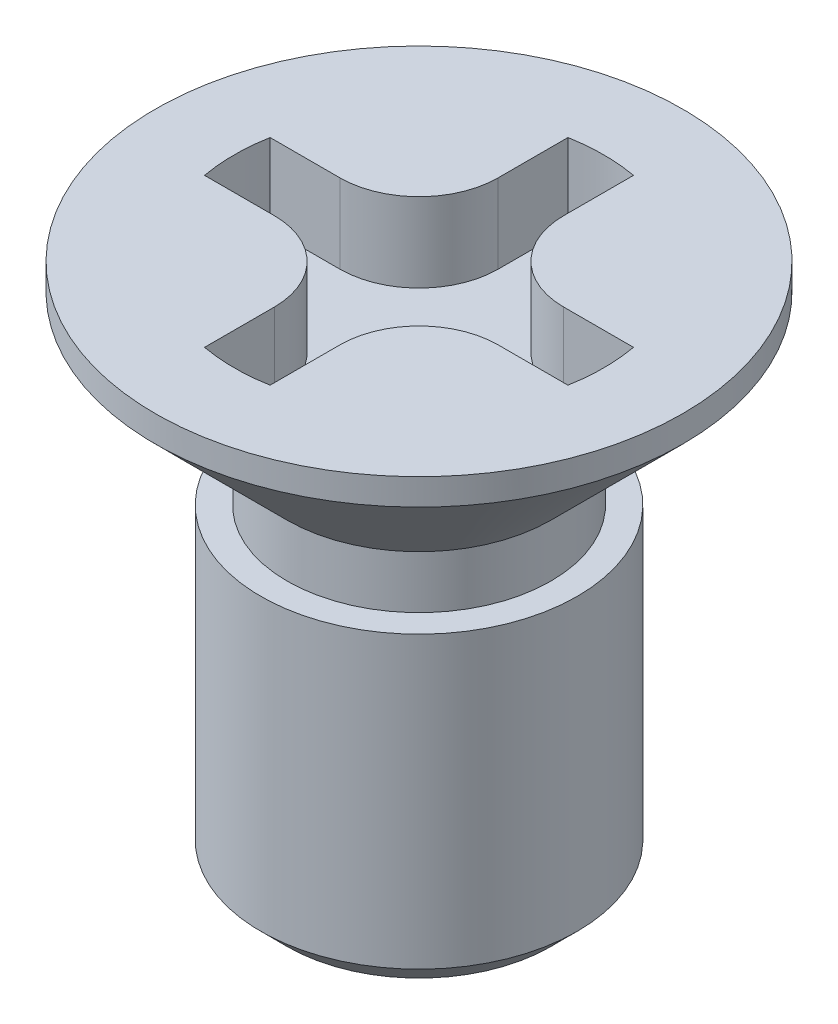
ISO-10303-21;
HEADER;
FILE_DESCRIPTION(('STEP AP214'),'2;1');
FILE_NAME('part.step','',(''),(''),'','','');
FILE_SCHEMA(('AUTOMOTIVE_DESIGN { 1 0 10303 214 1 1 1 1 }'));
ENDSEC;
DATA;
#1=APPLICATION_CONTEXT('core data for automotive mechanical design processes');
#2=APPLICATION_PROTOCOL_DEFINITION('international standard','automotive_design',2000,#1);
#3=PRODUCT_CONTEXT('',#1,'mechanical');
#4=PRODUCT('Part','Part','',(#3));
#5=PRODUCT_RELATED_PRODUCT_CATEGORY('part','',(#4));
#6=PRODUCT_DEFINITION_FORMATION('','',#4);
#7=PRODUCT_DEFINITION_CONTEXT('part definition',#1,'design');
#8=PRODUCT_DEFINITION('design','',#6,#7);
#9=PRODUCT_DEFINITION_SHAPE('','',#8);
#10=(LENGTH_UNIT() NAMED_UNIT(*) SI_UNIT(.MILLI.,.METRE.));
#11=(NAMED_UNIT(*) PLANE_ANGLE_UNIT() SI_UNIT($,.RADIAN.));
#12=(NAMED_UNIT(*) SI_UNIT($,.STERADIAN.) SOLID_ANGLE_UNIT());
#13=UNCERTAINTY_MEASURE_WITH_UNIT(LENGTH_MEASURE(1.E-05),#10,'distance_accuracy_value','');
#14=(GEOMETRIC_REPRESENTATION_CONTEXT(3) GLOBAL_UNCERTAINTY_ASSIGNED_CONTEXT((#13)) GLOBAL_UNIT_ASSIGNED_CONTEXT((#10,
#11,#12)) REPRESENTATION_CONTEXT('',''));
#15=CARTESIAN_POINT('',(0.,0.,0.));
#16=DIRECTION('',(0.,0.,1.));
#17=DIRECTION('',(1.,0.,0.));
#18=AXIS2_PLACEMENT_3D('',#15,#16,#17);
#19=CARTESIAN_POINT('',(0.,0.75,0.));
#20=DIRECTION('',(0.,-1.,0.));
#21=DIRECTION('',(0.,0.,-1.));
#22=AXIS2_PLACEMENT_3D('',#19,#20,#21);
#23=PLANE('',#22);
#24=DIRECTION('',(-1.,0.,0.));
#25=VECTOR('',#24,1.);
#26=CARTESIAN_POINT('',(-1.06066017178,0.75,0.3106601717798));
#27=LINE('',#26,#25);
#28=CARTESIAN_POINT('',(-1.06066017178,0.75,0.3106601717798));
#29=VERTEX_POINT('',#28);
#30=CARTESIAN_POINT('',(-1.722205056801,0.75,0.3106601717798));
#31=VERTEX_POINT('',#30);
#32=EDGE_CURVE('E335',#29,#31,#27,.T.);
#33=ORIENTED_EDGE('',*,*,#32,.F.);
#34=CARTESIAN_POINT('',(-1.06066017178,0.75,1.06066017178));
#35=DIRECTION('',(0.,1.,0.));
#36=DIRECTION('',(1.,0.,0.));
#37=AXIS2_PLACEMENT_3D('',#34,#35,#36);
#38=CIRCLE('',#37,0.75);
#39=CARTESIAN_POINT('',(-0.3106601717798,0.75,1.06066017178));
#40=VERTEX_POINT('',#39);
#41=EDGE_CURVE('E11',#40,#29,#38,.T.);
#42=ORIENTED_EDGE('',*,*,#41,.F.);
#43=DIRECTION('',(0.,0.,-1.));
#44=VECTOR('',#43,1.);
#45=CARTESIAN_POINT('',(-0.3106601717798,0.75,1.722205056801));
#46=LINE('',#45,#44);
#47=CARTESIAN_POINT('',(-0.3106601717798,0.75,1.722205056801));
#48=VERTEX_POINT('',#47);
#49=EDGE_CURVE('E42',#48,#40,#46,.T.);
#50=ORIENTED_EDGE('',*,*,#49,.F.);
#51=CARTESIAN_POINT('',(0.,0.75,0.));
#52=DIRECTION('',(0.,-1.,0.));
#53=DIRECTION('',(0.177520098159892,0.,0.984117175314658));
#54=AXIS2_PLACEMENT_3D('',#51,#52,#53);
#55=CIRCLE('',#54,1.75);
#56=CARTESIAN_POINT('',(0.3106601717798,0.75,1.722205056801));
#57=VERTEX_POINT('',#56);
#58=EDGE_CURVE('E264',#57,#48,#55,.T.);
#59=ORIENTED_EDGE('',*,*,#58,.F.);
#60=DIRECTION('',(0.,0.,1.));
#61=VECTOR('',#60,1.);
#62=CARTESIAN_POINT('',(0.3106601717798,0.75,1.06066017178));
#63=LINE('',#62,#61);
#64=CARTESIAN_POINT('',(0.3106601717798,0.75,1.06066017178));
#65=VERTEX_POINT('',#64);
#66=EDGE_CURVE('E265',#65,#57,#63,.T.);
#67=ORIENTED_EDGE('',*,*,#66,.F.);
#68=CARTESIAN_POINT('',(1.06066017178,0.75,1.06066017178));
#69=DIRECTION('',(0.,1.,0.));
#70=DIRECTION('',(0.,0.,-1.));
#71=AXIS2_PLACEMENT_3D('',#68,#69,#70);
#72=CIRCLE('',#71,0.75);
#73=CARTESIAN_POINT('',(1.06066017178,0.75,0.3106601717798));
#74=VERTEX_POINT('',#73);
#75=EDGE_CURVE('E253',#74,#65,#72,.T.);
#76=ORIENTED_EDGE('',*,*,#75,.F.);
#77=DIRECTION('',(-1.,0.,0.));
#78=VECTOR('',#77,1.);
#79=CARTESIAN_POINT('',(1.722205056801,0.75,0.3106601717798));
#80=LINE('',#79,#78);
#81=CARTESIAN_POINT('',(1.722205056801,0.75,0.3106601717798));
#82=VERTEX_POINT('',#81);
#83=EDGE_CURVE('E254',#82,#74,#80,.T.);
#84=ORIENTED_EDGE('',*,*,#83,.F.);
#85=CARTESIAN_POINT('',(0.,0.75,0.));
#86=DIRECTION('',(0.,-1.,0.));
#87=DIRECTION('',(0.984117175314658,0.,-0.177520098159892));
#88=AXIS2_PLACEMENT_3D('',#85,#86,#87);
#89=CIRCLE('',#88,1.75);
#90=CARTESIAN_POINT('',(1.722205056801,0.75,-0.3106601717798));
#91=VERTEX_POINT('',#90);
#92=EDGE_CURVE('E237',#91,#82,#89,.T.);
#93=ORIENTED_EDGE('',*,*,#92,.F.);
#94=DIRECTION('',(1.,0.,0.));
#95=VECTOR('',#94,1.);
#96=CARTESIAN_POINT('',(1.06066017178,0.75,-0.3106601717798));
#97=LINE('',#96,#95);
#98=CARTESIAN_POINT('',(1.06066017178,0.75,-0.3106601717798));
#99=VERTEX_POINT('',#98);
#100=EDGE_CURVE('E382',#99,#91,#97,.T.);
#101=ORIENTED_EDGE('',*,*,#100,.F.);
#102=CARTESIAN_POINT('',(1.06066017178,0.75,-1.06066017178));
#103=DIRECTION('',(0.,1.,0.));
#104=DIRECTION('',(-1.,0.,0.));
#105=AXIS2_PLACEMENT_3D('',#102,#103,#104);
#106=CIRCLE('',#105,0.75);
#107=CARTESIAN_POINT('',(0.3106601717798,0.75,-1.06066017178));
#108=VERTEX_POINT('',#107);
#109=EDGE_CURVE('E399',#108,#99,#106,.T.);
#110=ORIENTED_EDGE('',*,*,#109,.F.);
#111=DIRECTION('',(0.,0.,1.));
#112=VECTOR('',#111,1.);
#113=CARTESIAN_POINT('',(0.3106601717798,0.75,-1.722205056801));
#114=LINE('',#113,#112);
#115=CARTESIAN_POINT('',(0.3106601717798,0.75,-1.722205056801));
#116=VERTEX_POINT('',#115);
#117=EDGE_CURVE('E305',#116,#108,#114,.T.);
#118=ORIENTED_EDGE('',*,*,#117,.F.);
#119=CARTESIAN_POINT('',(0.,0.75,0.));
#120=DIRECTION('',(0.,-1.,0.));
#121=DIRECTION('',(-0.177520098159892,0.,-0.984117175314658));
#122=AXIS2_PLACEMENT_3D('',#119,#120,#121);
#123=CIRCLE('',#122,1.75);
#124=CARTESIAN_POINT('',(-0.3106601717798,0.75,-1.722205056801));
#125=VERTEX_POINT('',#124);
#126=EDGE_CURVE('E391',#125,#116,#123,.T.);
#127=ORIENTED_EDGE('',*,*,#126,.F.);
#128=DIRECTION('',(0.,0.,-1.));
#129=VECTOR('',#128,1.);
#130=CARTESIAN_POINT('',(-0.3106601717798,0.75,-1.06066017178));
#131=LINE('',#130,#129);
#132=CARTESIAN_POINT('',(-0.3106601717798,0.75,-1.06066017178));
#133=VERTEX_POINT('',#132);
#134=EDGE_CURVE('E295',#133,#125,#131,.T.);
#135=ORIENTED_EDGE('',*,*,#134,.F.);
#136=CARTESIAN_POINT('',(-1.06066017178,0.75,-1.06066017178));
#137=DIRECTION('',(0.,1.,0.));
#138=DIRECTION('',(0.,0.,1.));
#139=AXIS2_PLACEMENT_3D('',#136,#137,#138);
#140=CIRCLE('',#139,0.75);
#141=CARTESIAN_POINT('',(-1.06066017178,0.75,-0.3106601717798));
#142=VERTEX_POINT('',#141);
#143=EDGE_CURVE('E374',#142,#133,#140,.T.);
#144=ORIENTED_EDGE('',*,*,#143,.F.);
#145=DIRECTION('',(1.,0.,0.));
#146=VECTOR('',#145,1.);
#147=CARTESIAN_POINT('',(-1.722205056801,0.75,-0.3106601717798));
#148=LINE('',#147,#146);
#149=CARTESIAN_POINT('',(-1.722205056801,0.75,-0.3106601717798));
#150=VERTEX_POINT('',#149);
#151=EDGE_CURVE('E367',#150,#142,#148,.T.);
#152=ORIENTED_EDGE('',*,*,#151,.F.);
#153=CARTESIAN_POINT('',(0.,0.75,0.));
#154=DIRECTION('',(0.,-1.,0.));
#155=DIRECTION('',(-0.984117175314658,0.,0.177520098159892));
#156=AXIS2_PLACEMENT_3D('',#153,#154,#155);
#157=CIRCLE('',#156,1.75);
#158=EDGE_CURVE('E334',#31,#150,#157,.T.);
#159=ORIENTED_EDGE('',*,*,#158,.F.);
#160=EDGE_LOOP('',(#33,#42,#50,#59,#67,#76,#84,#93,#101,#110,#118,#127,#135,#144,#152,#159));
#161=FACE_BOUND('',#160,.T.);
#162=ADVANCED_FACE('F17',(#161),#23,.F.);
#163=CARTESIAN_POINT('',(-1.06066017178,0.75,1.06066017178));
#164=DIRECTION('',(0.,-1.,0.));
#165=DIRECTION('',(1.,0.,0.));
#166=AXIS2_PLACEMENT_3D('',#163,#164,#165);
#167=CYLINDRICAL_SURFACE('',#166,0.75);
#168=CARTESIAN_POINT('',(-1.06066017178,1.5,1.06066017178));
#169=DIRECTION('',(0.,1.,0.));
#170=DIRECTION('',(1.,0.,0.));
#171=AXIS2_PLACEMENT_3D('',#168,#169,#170);
#172=CIRCLE('',#171,0.75);
#173=CARTESIAN_POINT('',(-0.3106601717798,1.5,1.06066017178));
#174=VERTEX_POINT('',#173);
#175=CARTESIAN_POINT('',(-1.06066017178,1.5,0.3106601717798));
#176=VERTEX_POINT('',#175);
#177=EDGE_CURVE('E270',#174,#176,#172,.T.);
#178=ORIENTED_EDGE('',*,*,#177,.F.);
#179=DIRECTION('',(0.,1.,0.));
#180=VECTOR('',#179,1.);
#181=CARTESIAN_POINT('',(-0.3106601717798,0.75,1.06066017178));
#182=LINE('',#181,#180);
#183=EDGE_CURVE('E25',#40,#174,#182,.T.);
#184=ORIENTED_EDGE('',*,*,#183,.F.);
#185=ORIENTED_EDGE('',*,*,#41,.T.);
#186=DIRECTION('',(0.,1.,0.));
#187=VECTOR('',#186,1.);
#188=CARTESIAN_POINT('',(-1.06066017178,0.75,0.3106601717798));
#189=LINE('',#188,#187);
#190=EDGE_CURVE('E291',#29,#176,#189,.T.);
#191=ORIENTED_EDGE('',*,*,#190,.T.);
#192=EDGE_LOOP('',(#178,#184,#185,#191));
#193=FACE_BOUND('',#192,.T.);
#194=ADVANCED_FACE('F485',(#193),#167,.T.);
#195=CARTESIAN_POINT('',(-0.3106601717798,0.75,1.722205056801));
#196=DIRECTION('',(-1.,0.,0.));
#197=DIRECTION('',(0.,0.,1.));
#198=AXIS2_PLACEMENT_3D('',#195,#196,#197);
#199=PLANE('',#198);
#200=DIRECTION('',(0.,0.,-1.));
#201=VECTOR('',#200,1.);
#202=CARTESIAN_POINT('',(-0.3106601717798,1.5,1.722205056801));
#203=LINE('',#202,#201);
#204=CARTESIAN_POINT('',(-0.3106601717798,1.5,1.722205056801));
#205=VERTEX_POINT('',#204);
#206=EDGE_CURVE('E266',#205,#174,#203,.T.);
#207=ORIENTED_EDGE('',*,*,#206,.F.);
#208=DIRECTION('',(0.,1.,0.));
#209=VECTOR('',#208,1.);
#210=CARTESIAN_POINT('',(-0.3106601717798,0.75,1.722205056801));
#211=LINE('',#210,#209);
#212=EDGE_CURVE('E381',#48,#205,#211,.T.);
#213=ORIENTED_EDGE('',*,*,#212,.F.);
#214=ORIENTED_EDGE('',*,*,#49,.T.);
#215=ORIENTED_EDGE('',*,*,#183,.T.);
#216=EDGE_LOOP('',(#207,#213,#214,#215));
#217=FACE_BOUND('',#216,.T.);
#218=ADVANCED_FACE('F426',(#217),#199,.F.);
#219=CARTESIAN_POINT('',(0.,0.75,0.));
#220=DIRECTION('',(0.,-1.,0.));
#221=DIRECTION('',(1.,0.,0.));
#222=AXIS2_PLACEMENT_3D('',#219,#220,#221);
#223=CYLINDRICAL_SURFACE('',#222,1.75);
#224=CARTESIAN_POINT('',(0.,1.5,0.));
#225=DIRECTION('',(0.,-1.,0.));
#226=DIRECTION('',(0.177520098159892,0.,0.984117175314658));
#227=AXIS2_PLACEMENT_3D('',#224,#225,#226);
#228=CIRCLE('',#227,1.75);
#229=CARTESIAN_POINT('',(0.3106601717798,1.5,1.722205056801));
#230=VERTEX_POINT('',#229);
#231=EDGE_CURVE('E271',#230,#205,#228,.T.);
#232=ORIENTED_EDGE('',*,*,#231,.F.);
#233=DIRECTION('',(0.,1.,0.));
#234=VECTOR('',#233,1.);
#235=CARTESIAN_POINT('',(0.3106601717798,0.75,1.722205056801));
#236=LINE('',#235,#234);
#237=EDGE_CURVE('E261',#57,#230,#236,.T.);
#238=ORIENTED_EDGE('',*,*,#237,.F.);
#239=ORIENTED_EDGE('',*,*,#58,.T.);
#240=ORIENTED_EDGE('',*,*,#212,.T.);
#241=EDGE_LOOP('',(#232,#238,#239,#240));
#242=FACE_BOUND('',#241,.T.);
#243=ADVANCED_FACE('F431',(#242),#223,.F.);
#244=CARTESIAN_POINT('',(0.3106601717798,0.75,1.06066017178));
#245=DIRECTION('',(1.,0.,0.));
#246=DIRECTION('',(0.,1.,0.));
#247=AXIS2_PLACEMENT_3D('',#244,#245,#246);
#248=PLANE('',#247);
#249=DIRECTION('',(0.,0.,1.));
#250=VECTOR('',#249,1.);
#251=CARTESIAN_POINT('',(0.3106601717798,1.5,1.06066017178));
#252=LINE('',#251,#250);
#253=CARTESIAN_POINT('',(0.3106601717798,1.5,1.06066017178));
#254=VERTEX_POINT('',#253);
#255=EDGE_CURVE('E347',#254,#230,#252,.T.);
#256=ORIENTED_EDGE('',*,*,#255,.F.);
#257=DIRECTION('',(0.,1.,0.));
#258=VECTOR('',#257,1.);
#259=CARTESIAN_POINT('',(0.3106601717798,0.75,1.06066017178));
#260=LINE('',#259,#258);
#261=EDGE_CURVE('E415',#65,#254,#260,.T.);
#262=ORIENTED_EDGE('',*,*,#261,.F.);
#263=ORIENTED_EDGE('',*,*,#66,.T.);
#264=ORIENTED_EDGE('',*,*,#237,.T.);
#265=EDGE_LOOP('',(#256,#262,#263,#264));
#266=FACE_BOUND('',#265,.T.);
#267=ADVANCED_FACE('F436',(#266),#248,.F.);
#268=CARTESIAN_POINT('',(1.06066017178,0.75,1.06066017178));
#269=DIRECTION('',(0.,-1.,0.));
#270=DIRECTION('',(1.,0.,0.));
#271=AXIS2_PLACEMENT_3D('',#268,#269,#270);
#272=CYLINDRICAL_SURFACE('',#271,0.75);
#273=CARTESIAN_POINT('',(1.06066017178,1.5,1.06066017178));
#274=DIRECTION('',(0.,1.,0.));
#275=DIRECTION('',(0.,0.,-1.));
#276=AXIS2_PLACEMENT_3D('',#273,#274,#275);
#277=CIRCLE('',#276,0.75);
#278=CARTESIAN_POINT('',(1.06066017178,1.5,0.3106601717798));
#279=VERTEX_POINT('',#278);
#280=EDGE_CURVE('E343',#279,#254,#277,.T.);
#281=ORIENTED_EDGE('',*,*,#280,.F.);
#282=DIRECTION('',(0.,1.,0.));
#283=VECTOR('',#282,1.);
#284=CARTESIAN_POINT('',(1.06066017178,0.75,0.3106601717798));
#285=LINE('',#284,#283);
#286=EDGE_CURVE('E250',#74,#279,#285,.T.);
#287=ORIENTED_EDGE('',*,*,#286,.F.);
#288=ORIENTED_EDGE('',*,*,#75,.T.);
#289=ORIENTED_EDGE('',*,*,#261,.T.);
#290=EDGE_LOOP('',(#281,#287,#288,#289));
#291=FACE_BOUND('',#290,.T.);
#292=ADVANCED_FACE('F439',(#291),#272,.T.);
#293=CARTESIAN_POINT('',(1.722205056801,0.75,0.3106601717798));
#294=DIRECTION('',(0.,0.,1.));
#295=DIRECTION('',(1.,0.,0.));
#296=AXIS2_PLACEMENT_3D('',#293,#294,#295);
#297=PLANE('',#296);
#298=DIRECTION('',(-1.,0.,0.));
#299=VECTOR('',#298,1.);
#300=CARTESIAN_POINT('',(1.722205056801,1.5,0.3106601717798));
#301=LINE('',#300,#299);
#302=CARTESIAN_POINT('',(1.722205056801,1.5,0.3106601717798));
#303=VERTEX_POINT('',#302);
#304=EDGE_CURVE('E339',#303,#279,#301,.T.);
#305=ORIENTED_EDGE('',*,*,#304,.F.);
#306=DIRECTION('',(0.,1.,0.));
#307=VECTOR('',#306,1.);
#308=CARTESIAN_POINT('',(1.722205056801,0.75,0.3106601717798));
#309=LINE('',#308,#307);
#310=EDGE_CURVE('E241',#82,#303,#309,.T.);
#311=ORIENTED_EDGE('',*,*,#310,.F.);
#312=ORIENTED_EDGE('',*,*,#83,.T.);
#313=ORIENTED_EDGE('',*,*,#286,.T.);
#314=EDGE_LOOP('',(#305,#311,#312,#313));
#315=FACE_BOUND('',#314,.T.);
#316=ADVANCED_FACE('F443',(#315),#297,.F.);
#317=CARTESIAN_POINT('',(0.,0.75,0.));
#318=DIRECTION('',(0.,-1.,0.));
#319=DIRECTION('',(1.,0.,0.));
#320=AXIS2_PLACEMENT_3D('',#317,#318,#319);
#321=CYLINDRICAL_SURFACE('',#320,1.75);
#322=CARTESIAN_POINT('',(0.,1.5,0.));
#323=DIRECTION('',(0.,-1.,0.));
#324=DIRECTION('',(0.984117175314658,0.,-0.177520098159892));
#325=AXIS2_PLACEMENT_3D('',#322,#323,#324);
#326=CIRCLE('',#325,1.75);
#327=CARTESIAN_POINT('',(1.722205056801,1.5,-0.3106601717798));
#328=VERTEX_POINT('',#327);
#329=EDGE_CURVE('E330',#328,#303,#326,.T.);
#330=ORIENTED_EDGE('',*,*,#329,.F.);
#331=DIRECTION('',(0.,1.,0.));
#332=VECTOR('',#331,1.);
#333=CARTESIAN_POINT('',(1.722205056801,0.75,-0.3106601717798));
#334=LINE('',#333,#332);
#335=EDGE_CURVE('E242',#91,#328,#334,.T.);
#336=ORIENTED_EDGE('',*,*,#335,.F.);
#337=ORIENTED_EDGE('',*,*,#92,.T.);
#338=ORIENTED_EDGE('',*,*,#310,.T.);
#339=EDGE_LOOP('',(#330,#336,#337,#338));
#340=FACE_BOUND('',#339,.T.);
#341=ADVANCED_FACE('F448',(#340),#321,.F.);
#342=CARTESIAN_POINT('',(1.06066017178,0.75,-0.3106601717798));
#343=DIRECTION('',(0.,0.,-1.));
#344=DIRECTION('',(0.,-1.,0.));
#345=AXIS2_PLACEMENT_3D('',#342,#343,#344);
#346=PLANE('',#345);
#347=DIRECTION('',(0.,1.,0.));
#348=VECTOR('',#347,1.);
#349=CARTESIAN_POINT('',(1.06066017178,0.75,-0.3106601717798));
#350=LINE('',#349,#348);
#351=CARTESIAN_POINT('',(1.06066017178,1.5,-0.3106601717798));
#352=VERTEX_POINT('',#351);
#353=EDGE_CURVE('E386',#99,#352,#350,.T.);
#354=ORIENTED_EDGE('',*,*,#353,.F.);
#355=ORIENTED_EDGE('',*,*,#100,.T.);
#356=ORIENTED_EDGE('',*,*,#335,.T.);
#357=DIRECTION('',(1.,0.,0.));
#358=VECTOR('',#357,1.);
#359=CARTESIAN_POINT('',(1.06066017178,1.5,-0.3106601717798));
#360=LINE('',#359,#358);
#361=EDGE_CURVE('E326',#352,#328,#360,.T.);
#362=ORIENTED_EDGE('',*,*,#361,.F.);
#363=EDGE_LOOP('',(#354,#355,#356,#362));
#364=FACE_BOUND('',#363,.T.);
#365=ADVANCED_FACE('F451',(#364),#346,.F.);
#366=CARTESIAN_POINT('',(1.06066017178,0.75,-1.06066017178));
#367=DIRECTION('',(0.,-1.,0.));
#368=DIRECTION('',(1.,0.,0.));
#369=AXIS2_PLACEMENT_3D('',#366,#367,#368);
#370=CYLINDRICAL_SURFACE('',#369,0.75);
#371=DIRECTION('',(0.,1.,0.));
#372=VECTOR('',#371,1.);
#373=CARTESIAN_POINT('',(0.3106601717798,0.75,-1.06066017178));
#374=LINE('',#373,#372);
#375=CARTESIAN_POINT('',(0.3106601717798,1.5,-1.06066017178));
#376=VERTEX_POINT('',#375);
#377=EDGE_CURVE('E309',#108,#376,#374,.T.);
#378=ORIENTED_EDGE('',*,*,#377,.F.);
#379=ORIENTED_EDGE('',*,*,#109,.T.);
#380=ORIENTED_EDGE('',*,*,#353,.T.);
#381=CARTESIAN_POINT('',(1.06066017178,1.5,-1.06066017178));
#382=DIRECTION('',(0.,-1.,0.));
#383=DIRECTION('',(0.,0.,1.));
#384=AXIS2_PLACEMENT_3D('',#381,#382,#383);
#385=CIRCLE('',#384,0.75);
#386=EDGE_CURVE('E322',#352,#376,#385,.T.);
#387=ORIENTED_EDGE('',*,*,#386,.T.);
#388=EDGE_LOOP('',(#378,#379,#380,#387));
#389=FACE_BOUND('',#388,.T.);
#390=ADVANCED_FACE('F455',(#389),#370,.T.);
#391=CARTESIAN_POINT('',(0.3106601717798,0.75,-1.722205056801));
#392=DIRECTION('',(1.,0.,0.));
#393=DIRECTION('',(0.,1.,0.));
#394=AXIS2_PLACEMENT_3D('',#391,#392,#393);
#395=PLANE('',#394);
#396=DIRECTION('',(0.,1.,0.));
#397=VECTOR('',#396,1.);
#398=CARTESIAN_POINT('',(0.3106601717798,0.75,-1.722205056801));
#399=LINE('',#398,#397);
#400=CARTESIAN_POINT('',(0.3106601717798,1.5,-1.722205056801));
#401=VERTEX_POINT('',#400);
#402=EDGE_CURVE('E310',#116,#401,#399,.T.);
#403=ORIENTED_EDGE('',*,*,#402,.F.);
#404=ORIENTED_EDGE('',*,*,#117,.T.);
#405=ORIENTED_EDGE('',*,*,#377,.T.);
#406=DIRECTION('',(0.,0.,1.));
#407=VECTOR('',#406,1.);
#408=CARTESIAN_POINT('',(0.3106601717798,1.5,-1.722205056801));
#409=LINE('',#408,#407);
#410=EDGE_CURVE('E318',#401,#376,#409,.T.);
#411=ORIENTED_EDGE('',*,*,#410,.F.);
#412=EDGE_LOOP('',(#403,#404,#405,#411));
#413=FACE_BOUND('',#412,.T.);
#414=ADVANCED_FACE('F460',(#413),#395,.F.);
#415=CARTESIAN_POINT('',(0.,0.75,0.));
#416=DIRECTION('',(0.,-1.,0.));
#417=DIRECTION('',(1.,0.,0.));
#418=AXIS2_PLACEMENT_3D('',#415,#416,#417);
#419=CYLINDRICAL_SURFACE('',#418,1.75);
#420=DIRECTION('',(0.,1.,0.));
#421=VECTOR('',#420,1.);
#422=CARTESIAN_POINT('',(-0.3106601717798,0.75,-1.722205056801));
#423=LINE('',#422,#421);
#424=CARTESIAN_POINT('',(-0.3106601717798,1.5,-1.722205056801));
#425=VERTEX_POINT('',#424);
#426=EDGE_CURVE('E299',#125,#425,#423,.T.);
#427=ORIENTED_EDGE('',*,*,#426,.F.);
#428=ORIENTED_EDGE('',*,*,#126,.T.);
#429=ORIENTED_EDGE('',*,*,#402,.T.);
#430=CARTESIAN_POINT('',(0.,1.5,0.));
#431=DIRECTION('',(0.,-1.,0.));
#432=DIRECTION('',(-0.177520098159892,0.,-0.984117175314658));
#433=AXIS2_PLACEMENT_3D('',#430,#431,#432);
#434=CIRCLE('',#433,1.75);
#435=EDGE_CURVE('E314',#425,#401,#434,.T.);
#436=ORIENTED_EDGE('',*,*,#435,.F.);
#437=EDGE_LOOP('',(#427,#428,#429,#436));
#438=FACE_BOUND('',#437,.T.);
#439=ADVANCED_FACE('F463',(#438),#419,.F.);
#440=CARTESIAN_POINT('',(-0.3106601717798,0.75,-1.06066017178));
#441=DIRECTION('',(-1.,0.,0.));
#442=DIRECTION('',(0.,0.,1.));
#443=AXIS2_PLACEMENT_3D('',#440,#441,#442);
#444=PLANE('',#443);
#445=DIRECTION('',(0.,1.,0.));
#446=VECTOR('',#445,1.);
#447=CARTESIAN_POINT('',(-0.3106601717798,0.75,-1.06066017178));
#448=LINE('',#447,#446);
#449=CARTESIAN_POINT('',(-0.3106601717798,1.5,-1.06066017178));
#450=VERTEX_POINT('',#449);
#451=EDGE_CURVE('E300',#133,#450,#448,.T.);
#452=ORIENTED_EDGE('',*,*,#451,.F.);
#453=ORIENTED_EDGE('',*,*,#134,.T.);
#454=ORIENTED_EDGE('',*,*,#426,.T.);
#455=DIRECTION('',(0.,0.,-1.));
#456=VECTOR('',#455,1.);
#457=CARTESIAN_POINT('',(-0.3106601717798,1.5,-1.06066017178));
#458=LINE('',#457,#456);
#459=EDGE_CURVE('E304',#450,#425,#458,.T.);
#460=ORIENTED_EDGE('',*,*,#459,.F.);
#461=EDGE_LOOP('',(#452,#453,#454,#460));
#462=FACE_BOUND('',#461,.T.);
#463=ADVANCED_FACE('F467',(#462),#444,.F.);
#464=CARTESIAN_POINT('',(-1.06066017178,0.75,-1.06066017178));
#465=DIRECTION('',(0.,-1.,0.));
#466=DIRECTION('',(1.,0.,0.));
#467=AXIS2_PLACEMENT_3D('',#464,#465,#466);
#468=CYLINDRICAL_SURFACE('',#467,0.75);
#469=DIRECTION('',(0.,1.,0.));
#470=VECTOR('',#469,1.);
#471=CARTESIAN_POINT('',(-1.06066017178,0.75,-0.3106601717798));
#472=LINE('',#471,#470);
#473=CARTESIAN_POINT('',(-1.06066017178,1.5,-0.3106601717798));
#474=VERTEX_POINT('',#473);
#475=EDGE_CURVE('E371',#142,#474,#472,.T.);
#476=ORIENTED_EDGE('',*,*,#475,.F.);
#477=ORIENTED_EDGE('',*,*,#143,.T.);
#478=ORIENTED_EDGE('',*,*,#451,.T.);
#479=CARTESIAN_POINT('',(-1.06066017178,1.5,-1.06066017178));
#480=DIRECTION('',(0.,-1.,0.));
#481=DIRECTION('',(1.,0.,0.));
#482=AXIS2_PLACEMENT_3D('',#479,#480,#481);
#483=CIRCLE('',#482,0.75);
#484=EDGE_CURVE('E284',#450,#474,#483,.T.);
#485=ORIENTED_EDGE('',*,*,#484,.T.);
#486=EDGE_LOOP('',(#476,#477,#478,#485));
#487=FACE_BOUND('',#486,.T.);
#488=ADVANCED_FACE('F471',(#487),#468,.T.);
#489=CARTESIAN_POINT('',(-1.722205056801,0.75,-0.3106601717798));
#490=DIRECTION('',(0.,0.,-1.));
#491=DIRECTION('',(0.,-1.,0.));
#492=AXIS2_PLACEMENT_3D('',#489,#490,#491);
#493=PLANE('',#492);
#494=DIRECTION('',(0.,1.,0.));
#495=VECTOR('',#494,1.);
#496=CARTESIAN_POINT('',(-1.722205056801,0.75,-0.3106601717798));
#497=LINE('',#496,#495);
#498=CARTESIAN_POINT('',(-1.722205056801,1.5,-0.3106601717798));
#499=VERTEX_POINT('',#498);
#500=EDGE_CURVE('E364',#150,#499,#497,.T.);
#501=ORIENTED_EDGE('',*,*,#500,.F.);
#502=ORIENTED_EDGE('',*,*,#151,.T.);
#503=ORIENTED_EDGE('',*,*,#475,.T.);
#504=DIRECTION('',(1.,0.,0.));
#505=VECTOR('',#504,1.);
#506=CARTESIAN_POINT('',(-1.722205056801,1.5,-0.3106601717798));
#507=LINE('',#506,#505);
#508=EDGE_CURVE('E281',#499,#474,#507,.T.);
#509=ORIENTED_EDGE('',*,*,#508,.F.);
#510=EDGE_LOOP('',(#501,#502,#503,#509));
#511=FACE_BOUND('',#510,.T.);
#512=ADVANCED_FACE('F475',(#511),#493,.F.);
#513=CARTESIAN_POINT('',(0.,0.75,0.));
#514=DIRECTION('',(0.,-1.,0.));
#515=DIRECTION('',(-1.,0.,0.));
#516=AXIS2_PLACEMENT_3D('',#513,#514,#515);
#517=CYLINDRICAL_SURFACE('',#516,1.75);
#518=CARTESIAN_POINT('',(0.,1.5,0.));
#519=DIRECTION('',(0.,-1.,0.));
#520=DIRECTION('',(-0.984117175314658,0.,0.177520098159892));
#521=AXIS2_PLACEMENT_3D('',#518,#519,#520);
#522=CIRCLE('',#521,1.75);
#523=CARTESIAN_POINT('',(-1.722205056801,1.5,0.3106601717798));
#524=VERTEX_POINT('',#523);
#525=EDGE_CURVE('E278',#524,#499,#522,.T.);
#526=ORIENTED_EDGE('',*,*,#525,.F.);
#527=DIRECTION('',(0.,1.,0.));
#528=VECTOR('',#527,1.);
#529=CARTESIAN_POINT('',(-1.722205056801,0.75,0.3106601717798));
#530=LINE('',#529,#528);
#531=EDGE_CURVE('E331',#31,#524,#530,.T.);
#532=ORIENTED_EDGE('',*,*,#531,.F.);
#533=ORIENTED_EDGE('',*,*,#158,.T.);
#534=ORIENTED_EDGE('',*,*,#500,.T.);
#535=EDGE_LOOP('',(#526,#532,#533,#534));
#536=FACE_BOUND('',#535,.T.);
#537=ADVANCED_FACE('F479',(#536),#517,.F.);
#538=CARTESIAN_POINT('',(-1.06066017178,0.75,0.3106601717798));
#539=DIRECTION('',(0.,0.,1.));
#540=DIRECTION('',(1.,0.,0.));
#541=AXIS2_PLACEMENT_3D('',#538,#539,#540);
#542=PLANE('',#541);
#543=DIRECTION('',(-1.,0.,0.));
#544=VECTOR('',#543,1.);
#545=CARTESIAN_POINT('',(-1.06066017178,1.5,0.3106601717798));
#546=LINE('',#545,#544);
#547=EDGE_CURVE('E274',#176,#524,#546,.T.);
#548=ORIENTED_EDGE('',*,*,#547,.F.);
#549=ORIENTED_EDGE('',*,*,#190,.F.);
#550=ORIENTED_EDGE('',*,*,#32,.T.);
#551=ORIENTED_EDGE('',*,*,#531,.T.);
#552=EDGE_LOOP('',(#548,#549,#550,#551));
#553=FACE_BOUND('',#552,.T.);
#554=ADVANCED_FACE('F483',(#553),#542,.F.);
#555=CARTESIAN_POINT('',(0.,1.5,0.));
#556=DIRECTION('',(0.,-1.,0.));
#557=DIRECTION('',(0.,0.,-1.));
#558=AXIS2_PLACEMENT_3D('',#555,#556,#557);
#559=PLANE('',#558);
#560=ORIENTED_EDGE('',*,*,#547,.T.);
#561=ORIENTED_EDGE('',*,*,#525,.T.);
#562=ORIENTED_EDGE('',*,*,#508,.T.);
#563=ORIENTED_EDGE('',*,*,#484,.F.);
#564=ORIENTED_EDGE('',*,*,#459,.T.);
#565=ORIENTED_EDGE('',*,*,#435,.T.);
#566=ORIENTED_EDGE('',*,*,#410,.T.);
#567=ORIENTED_EDGE('',*,*,#386,.F.);
#568=ORIENTED_EDGE('',*,*,#361,.T.);
#569=ORIENTED_EDGE('',*,*,#329,.T.);
#570=ORIENTED_EDGE('',*,*,#304,.T.);
#571=ORIENTED_EDGE('',*,*,#280,.T.);
#572=ORIENTED_EDGE('',*,*,#255,.T.);
#573=ORIENTED_EDGE('',*,*,#231,.T.);
#574=ORIENTED_EDGE('',*,*,#206,.T.);
#575=ORIENTED_EDGE('',*,*,#177,.T.);
#576=EDGE_LOOP('',(#560,#561,#562,#563,#564,#565,#566,#567,#568,#569,#570,#571,#572,#573,#574,#575));
#577=FACE_BOUND('',#576,.T.);
#578=CARTESIAN_POINT('',(0.,1.5,0.));
#579=DIRECTION('',(0.,-1.,0.));
#580=DIRECTION('',(1.,0.,0.));
#581=AXIS2_PLACEMENT_3D('',#578,#579,#580);
#582=CIRCLE('',#581,2.5);
#583=CARTESIAN_POINT('',(2.5,1.5,0.));
#584=VERTEX_POINT('',#583);
#585=EDGE_CURVE('E247',#584,#584,#582,.T.);
#586=ORIENTED_EDGE('',*,*,#585,.F.);
#587=EDGE_LOOP('',(#586));
#588=FACE_BOUND('',#587,.T.);
#589=ADVANCED_FACE('F487',(#577,#588),#559,.F.);
#590=CARTESIAN_POINT('',(0.,1.75,0.));
#591=DIRECTION('',(0.,-1.,0.));
#592=DIRECTION('',(-1.,0.,0.));
#593=AXIS2_PLACEMENT_3D('',#590,#591,#592);
#594=CYLINDRICAL_SURFACE('',#593,2.5);
#595=CARTESIAN_POINT('',(0.,1.25,0.));
#596=DIRECTION('',(0.,-1.,0.));
#597=DIRECTION('',(1.,0.,0.));
#598=AXIS2_PLACEMENT_3D('',#595,#596,#597);
#599=CIRCLE('',#598,2.5);
#600=CARTESIAN_POINT('',(2.5,1.25,0.));
#601=VERTEX_POINT('',#600);
#602=CARTESIAN_POINT('',(-2.5,1.25,0.));
#603=VERTEX_POINT('',#602);
#604=EDGE_CURVE('E209',#601,#603,#599,.T.);
#605=ORIENTED_EDGE('',*,*,#604,.F.);
#606=DIRECTION('',(0.,1.,0.));
#607=VECTOR('',#606,1.);
#608=CARTESIAN_POINT('',(2.5,1.75,0.));
#609=LINE('',#608,#607);
#610=EDGE_CURVE('E243',#601,#584,#609,.T.);
#611=ORIENTED_EDGE('',*,*,#610,.T.);
#612=ORIENTED_EDGE('',*,*,#585,.T.);
#613=ORIENTED_EDGE('',*,*,#610,.F.);
#614=CARTESIAN_POINT('',(0.,1.25,0.));
#615=DIRECTION('',(0.,-1.,0.));
#616=DIRECTION('',(1.,0.,0.));
#617=AXIS2_PLACEMENT_3D('',#614,#615,#616);
#618=CIRCLE('',#617,2.5);
#619=EDGE_CURVE('E211',#603,#601,#618,.T.);
#620=ORIENTED_EDGE('',*,*,#619,.F.);
#621=EDGE_LOOP('',(#605,#611,#612,#613,#620));
#622=FACE_BOUND('',#621,.T.);
#623=ADVANCED_FACE('F490',(#622),#594,.T.);
#624=CARTESIAN_POINT('',(0.,0.625,0.));
#625=DIRECTION('',(0.,1.,0.));
#626=DIRECTION('',(1.,0.,0.));
#627=AXIS2_PLACEMENT_3D('',#624,#625,#626);
#628=CONICAL_SURFACE('',#627,1.875,0.785398163397448);
#629=ORIENTED_EDGE('',*,*,#604,.T.);
#630=DIRECTION('',(0.707106781186548,-0.707106781186548,0.));
#631=VECTOR('',#630,1.);
#632=CARTESIAN_POINT('',(-1.875,0.625,0.));
#633=LINE('',#632,#631);
#634=CARTESIAN_POINT('',(-1.25,0.,0.));
#635=VERTEX_POINT('',#634);
#636=EDGE_CURVE('E202',#603,#635,#633,.T.);
#637=ORIENTED_EDGE('',*,*,#636,.T.);
#638=CARTESIAN_POINT('',(0.,0.,0.));
#639=DIRECTION('',(0.,-1.,0.));
#640=DIRECTION('',(1.,0.,0.));
#641=AXIS2_PLACEMENT_3D('',#638,#639,#640);
#642=CIRCLE('',#641,1.25);
#643=EDGE_CURVE('E206',#635,#635,#642,.T.);
#644=ORIENTED_EDGE('',*,*,#643,.F.);
#645=ORIENTED_EDGE('',*,*,#636,.F.);
#646=ORIENTED_EDGE('',*,*,#619,.T.);
#647=EDGE_LOOP('',(#629,#637,#644,#645,#646));
#648=FACE_BOUND('',#647,.T.);
#649=ADVANCED_FACE('F204',(#648),#628,.T.);
#650=CARTESIAN_POINT('',(0.,-0.6,0.));
#651=DIRECTION('',(0.,1.,0.));
#652=DIRECTION('',(1.,0.,0.));
#653=AXIS2_PLACEMENT_3D('',#650,#651,#652);
#654=CYLINDRICAL_SURFACE('',#653,1.25);
#655=ORIENTED_EDGE('',*,*,#643,.T.);
#656=DIRECTION('',(0.,-1.,0.));
#657=VECTOR('',#656,1.);
#658=CARTESIAN_POINT('',(-1.25,-0.6,0.));
#659=LINE('',#658,#657);
#660=CARTESIAN_POINT('',(-1.25,-0.5,0.));
#661=VERTEX_POINT('',#660);
#662=EDGE_CURVE('E215',#635,#661,#659,.T.);
#663=ORIENTED_EDGE('',*,*,#662,.T.);
#664=CARTESIAN_POINT('',(0.,-0.5,0.));
#665=DIRECTION('',(0.,1.,0.));
#666=DIRECTION('',(1.,0.,0.));
#667=AXIS2_PLACEMENT_3D('',#664,#665,#666);
#668=CIRCLE('',#667,1.25);
#669=EDGE_CURVE('E218',#661,#661,#668,.T.);
#670=ORIENTED_EDGE('',*,*,#669,.T.);
#671=ORIENTED_EDGE('',*,*,#662,.F.);
#672=EDGE_LOOP('',(#655,#663,#670,#671));
#673=FACE_BOUND('',#672,.T.);
#674=ADVANCED_FACE('F216',(#673),#654,.T.);
#675=CARTESIAN_POINT('',(0.,-0.5,0.));
#676=DIRECTION('',(0.,1.,0.));
#677=DIRECTION('',(1.,0.,0.));
#678=AXIS2_PLACEMENT_3D('',#675,#676,#677);
#679=PLANE('',#678);
#680=ORIENTED_EDGE('',*,*,#669,.F.);
#681=EDGE_LOOP('',(#680));
#682=FACE_BOUND('',#681,.T.);
#683=CARTESIAN_POINT('',(0.,-0.5,0.));
#684=DIRECTION('',(0.,-1.,0.));
#685=DIRECTION('',(1.,0.,0.));
#686=AXIS2_PLACEMENT_3D('',#683,#684,#685);
#687=CIRCLE('',#686,1.5);
#688=CARTESIAN_POINT('',(1.5,-0.5,0.));
#689=VERTEX_POINT('',#688);
#690=EDGE_CURVE('E258',#689,#689,#687,.T.);
#691=ORIENTED_EDGE('',*,*,#690,.F.);
#692=EDGE_LOOP('',(#691));
#693=FACE_BOUND('',#692,.T.);
#694=ADVANCED_FACE('F519',(#682,#693),#679,.T.);
#695=CARTESIAN_POINT('',(0.,1.75,0.));
#696=DIRECTION('',(0.,-1.,0.));
#697=DIRECTION('',(-1.,0.,0.));
#698=AXIS2_PLACEMENT_3D('',#695,#696,#697);
#699=CYLINDRICAL_SURFACE('',#698,1.5);
#700=CARTESIAN_POINT('',(0.,-3.25,0.));
#701=DIRECTION('',(0.,-1.,0.));
#702=DIRECTION('',(-1.,0.,0.));
#703=AXIS2_PLACEMENT_3D('',#700,#701,#702);
#704=CIRCLE('',#703,1.5);
#705=CARTESIAN_POINT('',(1.5,-3.25,0.));
#706=VERTEX_POINT('',#705);
#707=CARTESIAN_POINT('',(-1.5,-3.25,0.));
#708=VERTEX_POINT('',#707);
#709=EDGE_CURVE('E230',#706,#708,#704,.T.);
#710=ORIENTED_EDGE('',*,*,#709,.F.);
#711=DIRECTION('',(0.,1.,0.));
#712=VECTOR('',#711,1.);
#713=CARTESIAN_POINT('',(1.5,1.75,0.));
#714=LINE('',#713,#712);
#715=EDGE_CURVE('E235',#706,#689,#714,.T.);
#716=ORIENTED_EDGE('',*,*,#715,.T.);
#717=ORIENTED_EDGE('',*,*,#690,.T.);
#718=ORIENTED_EDGE('',*,*,#715,.F.);
#719=CARTESIAN_POINT('',(0.,-3.25,0.));
#720=DIRECTION('',(0.,-1.,0.));
#721=DIRECTION('',(-1.,0.,0.));
#722=AXIS2_PLACEMENT_3D('',#719,#720,#721);
#723=CIRCLE('',#722,1.5);
#724=EDGE_CURVE('E232',#708,#706,#723,.T.);
#725=ORIENTED_EDGE('',*,*,#724,.F.);
#726=EDGE_LOOP('',(#710,#716,#717,#718,#725));
#727=FACE_BOUND('',#726,.T.);
#728=ADVANCED_FACE('F515',(#727),#699,.T.);
#729=CARTESIAN_POINT('',(0.,-3.375,0.));
#730=DIRECTION('',(0.,1.,0.));
#731=DIRECTION('',(1.,0.,0.));
#732=AXIS2_PLACEMENT_3D('',#729,#730,#731);
#733=CONICAL_SURFACE('',#732,1.375,0.785398163397448);
#734=ORIENTED_EDGE('',*,*,#709,.T.);
#735=DIRECTION('',(0.707106781186548,-0.707106781186548,0.));
#736=VECTOR('',#735,1.);
#737=CARTESIAN_POINT('',(-1.375,-3.375,0.));
#738=LINE('',#737,#736);
#739=CARTESIAN_POINT('',(-1.25,-3.5,0.));
#740=VERTEX_POINT('',#739);
#741=EDGE_CURVE('E236',#708,#740,#738,.T.);
#742=ORIENTED_EDGE('',*,*,#741,.T.);
#743=CARTESIAN_POINT('',(0.,-3.5,0.));
#744=DIRECTION('',(0.,1.,0.));
#745=DIRECTION('',(1.,0.,0.));
#746=AXIS2_PLACEMENT_3D('',#743,#744,#745);
#747=CIRCLE('',#746,1.25);
#748=EDGE_CURVE('E760',#740,#740,#747,.T.);
#749=ORIENTED_EDGE('',*,*,#748,.T.);
#750=ORIENTED_EDGE('',*,*,#741,.F.);
#751=ORIENTED_EDGE('',*,*,#724,.T.);
#752=EDGE_LOOP('',(#734,#742,#749,#750,#751));
#753=FACE_BOUND('',#752,.T.);
#754=ADVANCED_FACE('F511',(#753),#733,.T.);
#755=CARTESIAN_POINT('',(0.,-3.5,0.));
#756=DIRECTION('',(0.,-1.,0.));
#757=DIRECTION('',(0.,0.,-1.));
#758=AXIS2_PLACEMENT_3D('',#755,#756,#757);
#759=PLANE('',#758);
#760=ORIENTED_EDGE('',*,*,#748,.F.);
#761=EDGE_LOOP('',(#760));
#762=FACE_BOUND('',#761,.T.);
#763=ADVANCED_FACE('F514',(#762),#759,.T.);
#764=CLOSED_SHELL('',(#162,#194,#218,#243,#267,#292,#316,#341,#365,#390,#414,#439,#463,#488,
#512,#537,#554,#589,#623,#649,#674,#694,#728,#754,#763));
#765=MANIFOLD_SOLID_BREP('B1',#764);
#766=ADVANCED_BREP_SHAPE_REPRESENTATION('',(#18,#765),#14);
#767=SHAPE_DEFINITION_REPRESENTATION(#9,#766);
ENDSEC;
END-ISO-10303-21;
